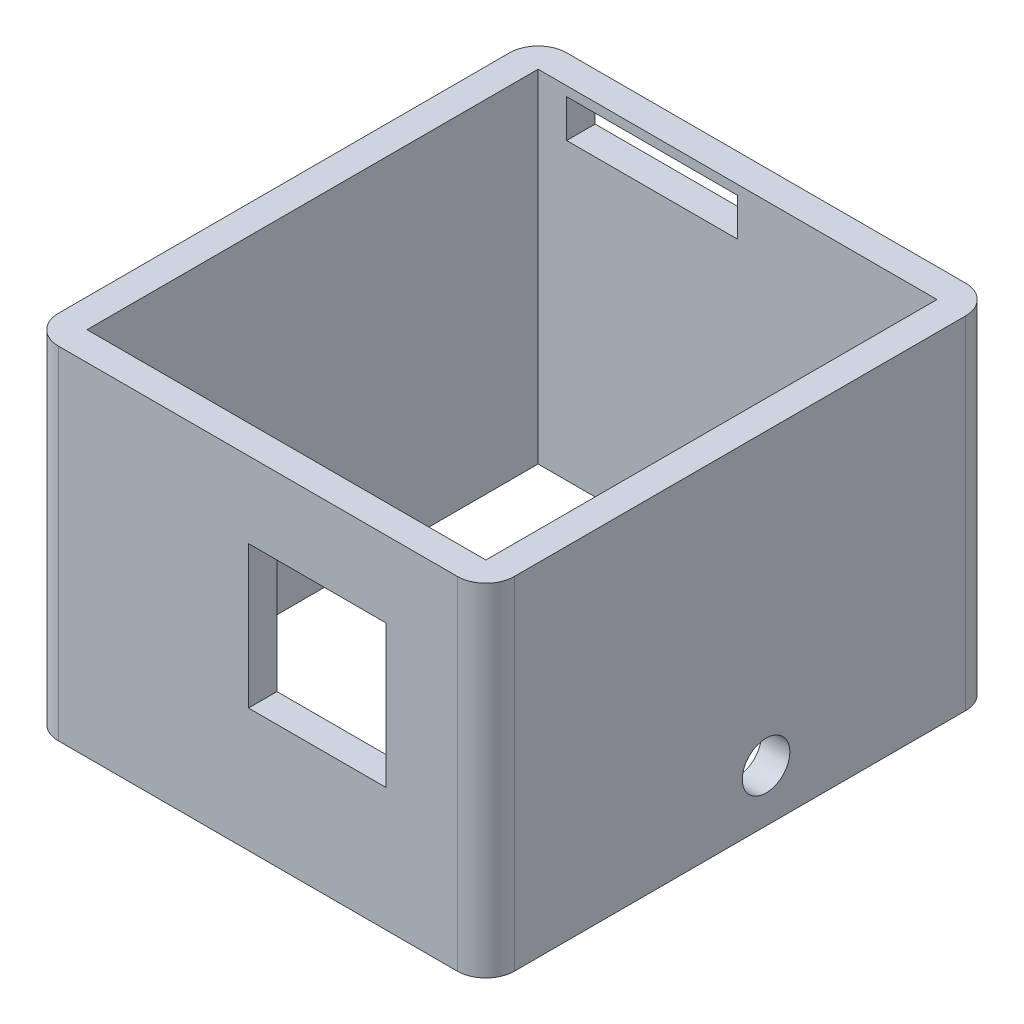
ISO-10303-21;
HEADER;
FILE_DESCRIPTION(('STEP AP214'),'2;1');
FILE_NAME('part.step','',(''),(''),'','','');
FILE_SCHEMA(('AUTOMOTIVE_DESIGN { 1 0 10303 214 1 1 1 1 }'));
ENDSEC;
DATA;
#1=APPLICATION_CONTEXT('core data for automotive mechanical design processes');
#2=APPLICATION_PROTOCOL_DEFINITION('international standard','automotive_design',2000,#1);
#3=PRODUCT_CONTEXT('',#1,'mechanical');
#4=PRODUCT('Part','Part','',(#3));
#5=PRODUCT_RELATED_PRODUCT_CATEGORY('part','',(#4));
#6=PRODUCT_DEFINITION_FORMATION('','',#4);
#7=PRODUCT_DEFINITION_CONTEXT('part definition',#1,'design');
#8=PRODUCT_DEFINITION('design','',#6,#7);
#9=PRODUCT_DEFINITION_SHAPE('','',#8);
#10=(LENGTH_UNIT() NAMED_UNIT(*) SI_UNIT(.MILLI.,.METRE.));
#11=(NAMED_UNIT(*) PLANE_ANGLE_UNIT() SI_UNIT($,.RADIAN.));
#12=(NAMED_UNIT(*) SI_UNIT($,.STERADIAN.) SOLID_ANGLE_UNIT());
#13=UNCERTAINTY_MEASURE_WITH_UNIT(LENGTH_MEASURE(1.E-05),#10,'distance_accuracy_value','');
#14=(GEOMETRIC_REPRESENTATION_CONTEXT(3) GLOBAL_UNCERTAINTY_ASSIGNED_CONTEXT((#13)) GLOBAL_UNIT_ASSIGNED_CONTEXT((#10,
#11,#12)) REPRESENTATION_CONTEXT('',''));
#15=CARTESIAN_POINT('',(0.,0.,0.));
#16=DIRECTION('',(0.,0.,1.));
#17=DIRECTION('',(1.,0.,0.));
#18=AXIS2_PLACEMENT_3D('',#15,#16,#17);
#19=CARTESIAN_POINT('',(-24.,36.,26.75));
#20=DIRECTION('',(0.,0.,-1.));
#21=DIRECTION('',(-1.,0.,0.));
#22=AXIS2_PLACEMENT_3D('',#19,#20,#21);
#23=PLANE('',#22);
#24=DIRECTION('',(1.,0.,0.));
#25=VECTOR('',#24,1.);
#26=CARTESIAN_POINT('',(-24.,0.,26.75));
#27=LINE('',#26,#25);
#28=CARTESIAN_POINT('',(-21.,0.,26.75));
#29=VERTEX_POINT('',#28);
#30=CARTESIAN_POINT('',(21.,0.,26.75));
#31=VERTEX_POINT('',#30);
#32=EDGE_CURVE('E292',#29,#31,#27,.T.);
#33=ORIENTED_EDGE('',*,*,#32,.T.);
#34=DIRECTION('',(0.,-1.,0.));
#35=VECTOR('',#34,1.);
#36=CARTESIAN_POINT('',(21.,36.,26.75));
#37=LINE('',#36,#35);
#38=CARTESIAN_POINT('',(21.,36.,26.75));
#39=VERTEX_POINT('',#38);
#40=EDGE_CURVE('E324',#31,#39,#37,.F.);
#41=ORIENTED_EDGE('',*,*,#40,.T.);
#42=DIRECTION('',(1.,0.,0.));
#43=VECTOR('',#42,1.);
#44=CARTESIAN_POINT('',(-24.,36.,26.75));
#45=LINE('',#44,#43);
#46=CARTESIAN_POINT('',(-21.,36.,26.75));
#47=VERTEX_POINT('',#46);
#48=EDGE_CURVE('E296',#47,#39,#45,.T.);
#49=ORIENTED_EDGE('',*,*,#48,.F.);
#50=DIRECTION('',(0.,-1.,0.));
#51=VECTOR('',#50,1.);
#52=CARTESIAN_POINT('',(-21.,36.,26.75));
#53=LINE('',#52,#51);
#54=EDGE_CURVE('E321',#47,#29,#53,.T.);
#55=ORIENTED_EDGE('',*,*,#54,.T.);
#56=EDGE_LOOP('',(#33,#41,#49,#55));
#57=FACE_BOUND('',#56,.T.);
#58=DIRECTION('',(0.,-1.,0.));
#59=VECTOR('',#58,1.);
#60=CARTESIAN_POINT('',(-1.00000000000239,36.,26.75));
#61=LINE('',#60,#59);
#62=CARTESIAN_POINT('',(-1.00000000000239,27.9999999999958,26.75));
#63=VERTEX_POINT('',#62);
#64=CARTESIAN_POINT('',(-1.00000000000239,13.0000000000026,26.75));
#65=VERTEX_POINT('',#64);
#66=EDGE_CURVE('E248',#63,#65,#61,.T.);
#67=ORIENTED_EDGE('',*,*,#66,.F.);
#68=DIRECTION('',(-1.,0.,0.));
#69=VECTOR('',#68,1.);
#70=CARTESIAN_POINT('',(-24.,27.9999999999958,26.75));
#71=LINE('',#70,#69);
#72=CARTESIAN_POINT('',(13.4999999999967,27.9999999999958,26.75));
#73=VERTEX_POINT('',#72);
#74=EDGE_CURVE('E241',#73,#63,#71,.T.);
#75=ORIENTED_EDGE('',*,*,#74,.F.);
#76=DIRECTION('',(0.,1.,0.));
#77=VECTOR('',#76,1.);
#78=CARTESIAN_POINT('',(13.4999999999967,36.,26.75));
#79=LINE('',#78,#77);
#80=CARTESIAN_POINT('',(13.4999999999967,13.0000000000026,26.75));
#81=VERTEX_POINT('',#80);
#82=EDGE_CURVE('E243',#81,#73,#79,.T.);
#83=ORIENTED_EDGE('',*,*,#82,.F.);
#84=DIRECTION('',(1.,0.,0.));
#85=VECTOR('',#84,1.);
#86=CARTESIAN_POINT('',(-24.,13.0000000000026,26.75));
#87=LINE('',#86,#85);
#88=EDGE_CURVE('E246',#65,#81,#87,.T.);
#89=ORIENTED_EDGE('',*,*,#88,.F.);
#90=EDGE_LOOP('',(#67,#75,#83,#89));
#91=FACE_BOUND('',#90,.T.);
#92=ADVANCED_FACE('F38',(#57,#91),#23,.F.);
#93=CARTESIAN_POINT('',(-21.,36.,23.75));
#94=DIRECTION('',(0.,0.,-1.));
#95=DIRECTION('',(-1.,0.,0.));
#96=AXIS2_PLACEMENT_3D('',#93,#94,#95);
#97=PLANE('',#96);
#98=DIRECTION('',(1.,0.,0.));
#99=VECTOR('',#98,1.);
#100=CARTESIAN_POINT('',(-21.,0.,23.75));
#101=LINE('',#100,#99);
#102=CARTESIAN_POINT('',(-21.,0.,23.75));
#103=VERTEX_POINT('',#102);
#104=CARTESIAN_POINT('',(21.,0.,23.75));
#105=VERTEX_POINT('',#104);
#106=EDGE_CURVE('E260',#103,#105,#101,.T.);
#107=ORIENTED_EDGE('',*,*,#106,.F.);
#108=DIRECTION('',(0.,-1.,0.));
#109=VECTOR('',#108,1.);
#110=CARTESIAN_POINT('',(-21.,36.,23.75));
#111=LINE('',#110,#109);
#112=CARTESIAN_POINT('',(-21.,36.,23.75));
#113=VERTEX_POINT('',#112);
#114=EDGE_CURVE('E280',#113,#103,#111,.T.);
#115=ORIENTED_EDGE('',*,*,#114,.F.);
#116=DIRECTION('',(1.,0.,0.));
#117=VECTOR('',#116,1.);
#118=CARTESIAN_POINT('',(-21.,36.,23.75));
#119=LINE('',#118,#117);
#120=CARTESIAN_POINT('',(21.,36.,23.75));
#121=VERTEX_POINT('',#120);
#122=EDGE_CURVE('E265',#113,#121,#119,.T.);
#123=ORIENTED_EDGE('',*,*,#122,.T.);
#124=DIRECTION('',(0.,-1.,0.));
#125=VECTOR('',#124,1.);
#126=CARTESIAN_POINT('',(21.,36.,23.75));
#127=LINE('',#126,#125);
#128=EDGE_CURVE('E267',#121,#105,#127,.T.);
#129=ORIENTED_EDGE('',*,*,#128,.T.);
#130=EDGE_LOOP('',(#107,#115,#123,#129));
#131=FACE_BOUND('',#130,.T.);
#132=DIRECTION('',(-1.,0.,0.));
#133=VECTOR('',#132,1.);
#134=CARTESIAN_POINT('',(-1.00000000000239,27.9999999999958,23.75));
#135=LINE('',#134,#133);
#136=CARTESIAN_POINT('',(13.4999999999967,27.9999999999958,23.75));
#137=VERTEX_POINT('',#136);
#138=CARTESIAN_POINT('',(-1.00000000000238,27.9999999999958,23.75));
#139=VERTEX_POINT('',#138);
#140=EDGE_CURVE('E229',#137,#139,#135,.T.);
#141=ORIENTED_EDGE('',*,*,#140,.T.);
#142=DIRECTION('',(0.,-1.,0.));
#143=VECTOR('',#142,1.);
#144=CARTESIAN_POINT('',(-1.00000000000239,13.0000000000026,23.75));
#145=LINE('',#144,#143);
#146=CARTESIAN_POINT('',(-1.00000000000239,13.0000000000026,23.75));
#147=VERTEX_POINT('',#146);
#148=EDGE_CURVE('E220',#139,#147,#145,.T.);
#149=ORIENTED_EDGE('',*,*,#148,.T.);
#150=DIRECTION('',(1.,0.,0.));
#151=VECTOR('',#150,1.);
#152=CARTESIAN_POINT('',(-1.00000000000239,13.0000000000026,23.75));
#153=LINE('',#152,#151);
#154=CARTESIAN_POINT('',(13.4999999999967,13.0000000000026,23.75));
#155=VERTEX_POINT('',#154);
#156=EDGE_CURVE('E223',#147,#155,#153,.T.);
#157=ORIENTED_EDGE('',*,*,#156,.T.);
#158=DIRECTION('',(0.,1.,0.));
#159=VECTOR('',#158,1.);
#160=CARTESIAN_POINT('',(13.4999999999967,13.0000000000026,23.75));
#161=LINE('',#160,#159);
#162=EDGE_CURVE('E226',#155,#137,#161,.T.);
#163=ORIENTED_EDGE('',*,*,#162,.T.);
#164=EDGE_LOOP('',(#141,#149,#157,#163));
#165=FACE_BOUND('',#164,.T.);
#166=ADVANCED_FACE('F378',(#131,#165),#97,.T.);
#167=CARTESIAN_POINT('',(0.,36.,0.));
#168=DIRECTION('',(0.,-1.,0.));
#169=DIRECTION('',(0.,0.,-1.));
#170=AXIS2_PLACEMENT_3D('',#167,#168,#169);
#171=PLANE('',#170);
#172=ORIENTED_EDGE('',*,*,#48,.T.);
#173=CARTESIAN_POINT('',(21.,36.,23.75));
#174=DIRECTION('',(0.,-1.,0.));
#175=DIRECTION('',(0.,0.,-1.));
#176=AXIS2_PLACEMENT_3D('',#173,#174,#175);
#177=CIRCLE('',#176,3.);
#178=CARTESIAN_POINT('',(24.,36.,23.75));
#179=VERTEX_POINT('',#178);
#180=EDGE_CURVE('E331',#39,#179,#177,.F.);
#181=ORIENTED_EDGE('',*,*,#180,.T.);
#182=DIRECTION('',(0.,0.,-1.));
#183=VECTOR('',#182,1.);
#184=CARTESIAN_POINT('',(24.,36.,26.75));
#185=LINE('',#184,#183);
#186=CARTESIAN_POINT('',(24.,36.,-23.75));
#187=VERTEX_POINT('',#186);
#188=EDGE_CURVE('E288',#179,#187,#185,.T.);
#189=ORIENTED_EDGE('',*,*,#188,.T.);
#190=CARTESIAN_POINT('',(21.,36.,-23.75));
#191=DIRECTION('',(0.,-1.,0.));
#192=DIRECTION('',(0.,0.,-1.));
#193=AXIS2_PLACEMENT_3D('',#190,#191,#192);
#194=CIRCLE('',#193,3.);
#195=CARTESIAN_POINT('',(21.,36.,-26.75));
#196=VERTEX_POINT('',#195);
#197=EDGE_CURVE('E326',#187,#196,#194,.F.);
#198=ORIENTED_EDGE('',*,*,#197,.T.);
#199=DIRECTION('',(-1.,0.,0.));
#200=VECTOR('',#199,1.);
#201=CARTESIAN_POINT('',(-24.,36.,-26.75));
#202=LINE('',#201,#200);
#203=CARTESIAN_POINT('',(-21.,36.,-26.75));
#204=VERTEX_POINT('',#203);
#205=EDGE_CURVE('E291',#196,#204,#202,.T.);
#206=ORIENTED_EDGE('',*,*,#205,.T.);
#207=CARTESIAN_POINT('',(-21.,36.,-23.75));
#208=DIRECTION('',(0.,-1.,0.));
#209=DIRECTION('',(0.,0.,-1.));
#210=AXIS2_PLACEMENT_3D('',#207,#208,#209);
#211=CIRCLE('',#210,3.);
#212=CARTESIAN_POINT('',(-24.,36.,-23.75));
#213=VERTEX_POINT('',#212);
#214=EDGE_CURVE('E60',#204,#213,#211,.F.);
#215=ORIENTED_EDGE('',*,*,#214,.T.);
#216=DIRECTION('',(0.,0.,1.));
#217=VECTOR('',#216,1.);
#218=CARTESIAN_POINT('',(-24.,36.,26.75));
#219=LINE('',#218,#217);
#220=CARTESIAN_POINT('',(-24.,36.,23.75));
#221=VERTEX_POINT('',#220);
#222=EDGE_CURVE('E294',#213,#221,#219,.T.);
#223=ORIENTED_EDGE('',*,*,#222,.T.);
#224=CARTESIAN_POINT('',(-21.,36.,23.75));
#225=DIRECTION('',(0.,-1.,0.));
#226=DIRECTION('',(0.,0.,-1.));
#227=AXIS2_PLACEMENT_3D('',#224,#225,#226);
#228=CIRCLE('',#227,3.);
#229=EDGE_CURVE('E329',#221,#47,#228,.F.);
#230=ORIENTED_EDGE('',*,*,#229,.T.);
#231=EDGE_LOOP('',(#172,#181,#189,#198,#206,#215,#223,#230));
#232=FACE_BOUND('',#231,.T.);
#233=DIRECTION('',(0.,0.,-1.));
#234=VECTOR('',#233,1.);
#235=CARTESIAN_POINT('',(21.,36.,23.75));
#236=LINE('',#235,#234);
#237=CARTESIAN_POINT('',(21.,36.,-23.75));
#238=VERTEX_POINT('',#237);
#239=EDGE_CURVE('E257',#121,#238,#236,.T.);
#240=ORIENTED_EDGE('',*,*,#239,.F.);
#241=ORIENTED_EDGE('',*,*,#122,.F.);
#242=DIRECTION('',(0.,0.,1.));
#243=VECTOR('',#242,1.);
#244=CARTESIAN_POINT('',(-21.,36.,23.75));
#245=LINE('',#244,#243);
#246=CARTESIAN_POINT('',(-21.,36.,-23.75));
#247=VERTEX_POINT('',#246);
#248=EDGE_CURVE('E262',#247,#113,#245,.T.);
#249=ORIENTED_EDGE('',*,*,#248,.F.);
#250=DIRECTION('',(-1.,0.,0.));
#251=VECTOR('',#250,1.);
#252=CARTESIAN_POINT('',(-21.,36.,-23.75));
#253=LINE('',#252,#251);
#254=EDGE_CURVE('E259',#238,#247,#253,.T.);
#255=ORIENTED_EDGE('',*,*,#254,.F.);
#256=EDGE_LOOP('',(#240,#241,#249,#255));
#257=FACE_BOUND('',#256,.T.);
#258=ADVANCED_FACE('F355',(#232,#257),#171,.F.);
#259=CARTESIAN_POINT('',(0.,0.,0.));
#260=DIRECTION('',(0.,-1.,0.));
#261=DIRECTION('',(0.,0.,-1.));
#262=AXIS2_PLACEMENT_3D('',#259,#260,#261);
#263=PLANE('',#262);
#264=DIRECTION('',(0.,0.,-1.));
#265=VECTOR('',#264,1.);
#266=CARTESIAN_POINT('',(24.,0.,26.75));
#267=LINE('',#266,#265);
#268=CARTESIAN_POINT('',(24.,0.,23.75));
#269=VERTEX_POINT('',#268);
#270=CARTESIAN_POINT('',(24.,0.,-23.75));
#271=VERTEX_POINT('',#270);
#272=EDGE_CURVE('E287',#269,#271,#267,.T.);
#273=ORIENTED_EDGE('',*,*,#272,.F.);
#274=CARTESIAN_POINT('',(21.,0.,23.75));
#275=DIRECTION('',(0.,-1.,0.));
#276=DIRECTION('',(0.,0.,-1.));
#277=AXIS2_PLACEMENT_3D('',#274,#275,#276);
#278=CIRCLE('',#277,3.);
#279=EDGE_CURVE('E319',#269,#31,#278,.T.);
#280=ORIENTED_EDGE('',*,*,#279,.T.);
#281=ORIENTED_EDGE('',*,*,#32,.F.);
#282=CARTESIAN_POINT('',(-21.,0.,23.75));
#283=DIRECTION('',(0.,-1.,0.));
#284=DIRECTION('',(0.,0.,-1.));
#285=AXIS2_PLACEMENT_3D('',#282,#283,#284);
#286=CIRCLE('',#285,3.);
#287=CARTESIAN_POINT('',(-24.,0.,23.75));
#288=VERTEX_POINT('',#287);
#289=EDGE_CURVE('E317',#29,#288,#286,.T.);
#290=ORIENTED_EDGE('',*,*,#289,.T.);
#291=DIRECTION('',(0.,0.,1.));
#292=VECTOR('',#291,1.);
#293=CARTESIAN_POINT('',(-24.,0.,26.75));
#294=LINE('',#293,#292);
#295=CARTESIAN_POINT('',(-24.,0.,-23.75));
#296=VERTEX_POINT('',#295);
#297=EDGE_CURVE('E305',#296,#288,#294,.T.);
#298=ORIENTED_EDGE('',*,*,#297,.F.);
#299=CARTESIAN_POINT('',(-21.,0.,-23.75));
#300=DIRECTION('',(0.,-1.,0.));
#301=DIRECTION('',(0.,0.,-1.));
#302=AXIS2_PLACEMENT_3D('',#299,#300,#301);
#303=CIRCLE('',#302,3.);
#304=CARTESIAN_POINT('',(-21.,0.,-26.75));
#305=VERTEX_POINT('',#304);
#306=EDGE_CURVE('E315',#296,#305,#303,.T.);
#307=ORIENTED_EDGE('',*,*,#306,.T.);
#308=DIRECTION('',(-1.,0.,0.));
#309=VECTOR('',#308,1.);
#310=CARTESIAN_POINT('',(-24.,0.,-26.75));
#311=LINE('',#310,#309);
#312=CARTESIAN_POINT('',(21.,0.,-26.75));
#313=VERTEX_POINT('',#312);
#314=EDGE_CURVE('E302',#313,#305,#311,.T.);
#315=ORIENTED_EDGE('',*,*,#314,.F.);
#316=CARTESIAN_POINT('',(21.,0.,-23.75));
#317=DIRECTION('',(0.,-1.,0.));
#318=DIRECTION('',(0.,0.,-1.));
#319=AXIS2_PLACEMENT_3D('',#316,#317,#318);
#320=CIRCLE('',#319,3.);
#321=EDGE_CURVE('E313',#313,#271,#320,.T.);
#322=ORIENTED_EDGE('',*,*,#321,.T.);
#323=EDGE_LOOP('',(#273,#280,#281,#290,#298,#307,#315,#322));
#324=FACE_BOUND('',#323,.T.);
#325=ORIENTED_EDGE('',*,*,#106,.T.);
#326=DIRECTION('',(0.,0.,-1.));
#327=VECTOR('',#326,1.);
#328=CARTESIAN_POINT('',(21.,0.,23.75));
#329=LINE('',#328,#327);
#330=CARTESIAN_POINT('',(21.,0.,-23.75));
#331=VERTEX_POINT('',#330);
#332=EDGE_CURVE('E256',#105,#331,#329,.T.);
#333=ORIENTED_EDGE('',*,*,#332,.T.);
#334=DIRECTION('',(-1.,0.,0.));
#335=VECTOR('',#334,1.);
#336=CARTESIAN_POINT('',(-21.,0.,-23.75));
#337=LINE('',#336,#335);
#338=CARTESIAN_POINT('',(-21.,0.,-23.75));
#339=VERTEX_POINT('',#338);
#340=EDGE_CURVE('E270',#331,#339,#337,.T.);
#341=ORIENTED_EDGE('',*,*,#340,.T.);
#342=DIRECTION('',(0.,0.,1.));
#343=VECTOR('',#342,1.);
#344=CARTESIAN_POINT('',(-21.,0.,23.75));
#345=LINE('',#344,#343);
#346=EDGE_CURVE('E273',#339,#103,#345,.T.);
#347=ORIENTED_EDGE('',*,*,#346,.T.);
#348=EDGE_LOOP('',(#325,#333,#341,#347));
#349=FACE_BOUND('',#348,.T.);
#350=ADVANCED_FACE('F347',(#324,#349),#263,.T.);
#351=CARTESIAN_POINT('',(24.,36.,26.75));
#352=DIRECTION('',(-1.,0.,0.));
#353=DIRECTION('',(0.,0.,1.));
#354=AXIS2_PLACEMENT_3D('',#351,#352,#353);
#355=PLANE('',#354);
#356=CARTESIAN_POINT('',(24.,5.5,-2.75));
#357=DIRECTION('',(-1.,0.,0.));
#358=DIRECTION('',(0.,0.,1.));
#359=AXIS2_PLACEMENT_3D('',#356,#357,#358);
#360=CIRCLE('',#359,2.5);
#361=CARTESIAN_POINT('',(24.,5.5,-0.250000000000002));
#362=VERTEX_POINT('',#361);
#363=EDGE_CURVE('E253',#362,#362,#360,.F.);
#364=ORIENTED_EDGE('',*,*,#363,.F.);
#365=EDGE_LOOP('',(#364));
#366=FACE_BOUND('',#365,.T.);
#367=ORIENTED_EDGE('',*,*,#188,.F.);
#368=DIRECTION('',(0.,-1.,0.));
#369=VECTOR('',#368,1.);
#370=CARTESIAN_POINT('',(24.,36.,23.75));
#371=LINE('',#370,#369);
#372=EDGE_CURVE('E310',#179,#269,#371,.T.);
#373=ORIENTED_EDGE('',*,*,#372,.T.);
#374=ORIENTED_EDGE('',*,*,#272,.T.);
#375=DIRECTION('',(0.,-1.,0.));
#376=VECTOR('',#375,1.);
#377=CARTESIAN_POINT('',(24.,36.,-23.75));
#378=LINE('',#377,#376);
#379=EDGE_CURVE('E299',#271,#187,#378,.F.);
#380=ORIENTED_EDGE('',*,*,#379,.T.);
#381=EDGE_LOOP('',(#367,#373,#374,#380));
#382=FACE_BOUND('',#381,.T.);
#383=ADVANCED_FACE('F371',(#366,#382),#355,.F.);
#384=CARTESIAN_POINT('',(-24.,36.,-26.75));
#385=DIRECTION('',(0.,0.,1.));
#386=DIRECTION('',(1.,0.,0.));
#387=AXIS2_PLACEMENT_3D('',#384,#385,#386);
#388=PLANE('',#387);
#389=DIRECTION('',(1.,0.,0.));
#390=VECTOR('',#389,1.);
#391=CARTESIAN_POINT('',(-24.,30.9999999999745,-26.75));
#392=LINE('',#391,#390);
#393=CARTESIAN_POINT('',(-18.0000000000005,30.9999999999745,-26.75));
#394=VERTEX_POINT('',#393);
#395=CARTESIAN_POINT('',(0.,30.9999999999745,-26.75));
#396=VERTEX_POINT('',#395);
#397=EDGE_CURVE('E214',#394,#396,#392,.T.);
#398=ORIENTED_EDGE('',*,*,#397,.T.);
#399=DIRECTION('',(0.,1.,0.));
#400=VECTOR('',#399,1.);
#401=CARTESIAN_POINT('',(0.,36.,-26.75));
#402=LINE('',#401,#400);
#403=CARTESIAN_POINT('',(0.,34.9999999999968,-26.75));
#404=VERTEX_POINT('',#403);
#405=EDGE_CURVE('E217',#396,#404,#402,.T.);
#406=ORIENTED_EDGE('',*,*,#405,.T.);
#407=DIRECTION('',(-1.,0.,0.));
#408=VECTOR('',#407,1.);
#409=CARTESIAN_POINT('',(-24.,34.9999999999968,-26.75));
#410=LINE('',#409,#408);
#411=CARTESIAN_POINT('',(-18.0000000000005,34.9999999999968,-26.75));
#412=VERTEX_POINT('',#411);
#413=EDGE_CURVE('E209',#404,#412,#410,.T.);
#414=ORIENTED_EDGE('',*,*,#413,.T.);
#415=DIRECTION('',(0.,-1.,0.));
#416=VECTOR('',#415,1.);
#417=CARTESIAN_POINT('',(-18.0000000000005,36.,-26.75));
#418=LINE('',#417,#416);
#419=EDGE_CURVE('E184',#412,#394,#418,.T.);
#420=ORIENTED_EDGE('',*,*,#419,.T.);
#421=EDGE_LOOP('',(#398,#406,#414,#420));
#422=FACE_BOUND('',#421,.T.);
#423=ORIENTED_EDGE('',*,*,#314,.T.);
#424=DIRECTION('',(0.,-1.,0.));
#425=VECTOR('',#424,1.);
#426=CARTESIAN_POINT('',(-21.,36.,-26.75));
#427=LINE('',#426,#425);
#428=EDGE_CURVE('E11',#305,#204,#427,.F.);
#429=ORIENTED_EDGE('',*,*,#428,.T.);
#430=ORIENTED_EDGE('',*,*,#205,.F.);
#431=DIRECTION('',(0.,-1.,0.));
#432=VECTOR('',#431,1.);
#433=CARTESIAN_POINT('',(21.,36.,-26.75));
#434=LINE('',#433,#432);
#435=EDGE_CURVE('E46',#196,#313,#434,.T.);
#436=ORIENTED_EDGE('',*,*,#435,.T.);
#437=EDGE_LOOP('',(#423,#429,#430,#436));
#438=FACE_BOUND('',#437,.T.);
#439=ADVANCED_FACE('F341',(#422,#438),#388,.F.);
#440=CARTESIAN_POINT('',(-24.,36.,26.75));
#441=DIRECTION('',(1.,0.,0.));
#442=DIRECTION('',(0.,0.,-1.));
#443=AXIS2_PLACEMENT_3D('',#440,#441,#442);
#444=PLANE('',#443);
#445=ORIENTED_EDGE('',*,*,#297,.T.);
#446=DIRECTION('',(0.,-1.,0.));
#447=VECTOR('',#446,1.);
#448=CARTESIAN_POINT('',(-24.,36.,23.75));
#449=LINE('',#448,#447);
#450=EDGE_CURVE('E53',#288,#221,#449,.F.);
#451=ORIENTED_EDGE('',*,*,#450,.T.);
#452=ORIENTED_EDGE('',*,*,#222,.F.);
#453=DIRECTION('',(0.,-1.,0.));
#454=VECTOR('',#453,1.);
#455=CARTESIAN_POINT('',(-24.,36.,-23.75));
#456=LINE('',#455,#454);
#457=EDGE_CURVE('E333',#213,#296,#456,.T.);
#458=ORIENTED_EDGE('',*,*,#457,.T.);
#459=EDGE_LOOP('',(#445,#451,#452,#458));
#460=FACE_BOUND('',#459,.T.);
#461=ADVANCED_FACE('F353',(#460),#444,.F.);
#462=CARTESIAN_POINT('',(21.,36.,23.75));
#463=DIRECTION('',(-1.,0.,0.));
#464=DIRECTION('',(0.,0.,1.));
#465=AXIS2_PLACEMENT_3D('',#462,#463,#464);
#466=PLANE('',#465);
#467=CARTESIAN_POINT('',(21.,5.5,-2.75));
#468=DIRECTION('',(1.,0.,0.));
#469=DIRECTION('',(0.,0.,-1.));
#470=AXIS2_PLACEMENT_3D('',#467,#468,#469);
#471=CIRCLE('',#470,2.5);
#472=CARTESIAN_POINT('',(21.,5.5,-5.25));
#473=VERTEX_POINT('',#472);
#474=EDGE_CURVE('E250',#473,#473,#471,.T.);
#475=ORIENTED_EDGE('',*,*,#474,.T.);
#476=EDGE_LOOP('',(#475));
#477=FACE_BOUND('',#476,.T.);
#478=ORIENTED_EDGE('',*,*,#332,.F.);
#479=ORIENTED_EDGE('',*,*,#128,.F.);
#480=ORIENTED_EDGE('',*,*,#239,.T.);
#481=DIRECTION('',(0.,-1.,0.));
#482=VECTOR('',#481,1.);
#483=CARTESIAN_POINT('',(21.,36.,-23.75));
#484=LINE('',#483,#482);
#485=EDGE_CURVE('E284',#238,#331,#484,.T.);
#486=ORIENTED_EDGE('',*,*,#485,.T.);
#487=EDGE_LOOP('',(#478,#479,#480,#486));
#488=FACE_BOUND('',#487,.T.);
#489=ADVANCED_FACE('F390',(#477,#488),#466,.T.);
#490=CARTESIAN_POINT('',(-21.,36.,-23.75));
#491=DIRECTION('',(0.,0.,1.));
#492=DIRECTION('',(1.,0.,0.));
#493=AXIS2_PLACEMENT_3D('',#490,#491,#492);
#494=PLANE('',#493);
#495=DIRECTION('',(0.,1.,0.));
#496=VECTOR('',#495,1.);
#497=CARTESIAN_POINT('',(0.,30.9999999999745,-23.75));
#498=LINE('',#497,#496);
#499=CARTESIAN_POINT('',(0.,30.9999999999745,-23.75));
#500=VERTEX_POINT('',#499);
#501=CARTESIAN_POINT('',(0.,34.9999999999968,-23.75));
#502=VERTEX_POINT('',#501);
#503=EDGE_CURVE('E197',#500,#502,#498,.T.);
#504=ORIENTED_EDGE('',*,*,#503,.F.);
#505=DIRECTION('',(1.,0.,0.));
#506=VECTOR('',#505,1.);
#507=CARTESIAN_POINT('',(0.,30.9999999999745,-23.75));
#508=LINE('',#507,#506);
#509=CARTESIAN_POINT('',(-18.0000000000005,30.9999999999745,-23.75));
#510=VERTEX_POINT('',#509);
#511=EDGE_CURVE('E202',#510,#500,#508,.T.);
#512=ORIENTED_EDGE('',*,*,#511,.F.);
#513=DIRECTION('',(0.,-1.,0.));
#514=VECTOR('',#513,1.);
#515=CARTESIAN_POINT('',(-18.0000000000005,30.9999999999745,-23.75));
#516=LINE('',#515,#514);
#517=CARTESIAN_POINT('',(-18.0000000000005,34.9999999999968,-23.75));
#518=VERTEX_POINT('',#517);
#519=EDGE_CURVE('E181',#518,#510,#516,.T.);
#520=ORIENTED_EDGE('',*,*,#519,.F.);
#521=DIRECTION('',(-1.,0.,0.));
#522=VECTOR('',#521,1.);
#523=CARTESIAN_POINT('',(0.,34.9999999999968,-23.75));
#524=LINE('',#523,#522);
#525=EDGE_CURVE('E192',#502,#518,#524,.T.);
#526=ORIENTED_EDGE('',*,*,#525,.F.);
#527=EDGE_LOOP('',(#504,#512,#520,#526));
#528=FACE_BOUND('',#527,.T.);
#529=ORIENTED_EDGE('',*,*,#340,.F.);
#530=ORIENTED_EDGE('',*,*,#485,.F.);
#531=ORIENTED_EDGE('',*,*,#254,.T.);
#532=DIRECTION('',(0.,-1.,0.));
#533=VECTOR('',#532,1.);
#534=CARTESIAN_POINT('',(-21.,36.,-23.75));
#535=LINE('',#534,#533);
#536=EDGE_CURVE('E282',#247,#339,#535,.T.);
#537=ORIENTED_EDGE('',*,*,#536,.T.);
#538=EDGE_LOOP('',(#529,#530,#531,#537));
#539=FACE_BOUND('',#538,.T.);
#540=ADVANCED_FACE('F199',(#528,#539),#494,.T.);
#541=CARTESIAN_POINT('',(-21.,36.,23.75));
#542=DIRECTION('',(1.,0.,0.));
#543=DIRECTION('',(0.,0.,-1.));
#544=AXIS2_PLACEMENT_3D('',#541,#542,#543);
#545=PLANE('',#544);
#546=ORIENTED_EDGE('',*,*,#346,.F.);
#547=ORIENTED_EDGE('',*,*,#536,.F.);
#548=ORIENTED_EDGE('',*,*,#248,.T.);
#549=ORIENTED_EDGE('',*,*,#114,.T.);
#550=EDGE_LOOP('',(#546,#547,#548,#549));
#551=FACE_BOUND('',#550,.T.);
#552=ADVANCED_FACE('F509',(#551),#545,.T.);
#553=CARTESIAN_POINT('',(30.,5.5,-2.75));
#554=DIRECTION('',(-1.,0.,0.));
#555=DIRECTION('',(0.,0.,1.));
#556=AXIS2_PLACEMENT_3D('',#553,#554,#555);
#557=CYLINDRICAL_SURFACE('',#556,2.5);
#558=ORIENTED_EDGE('',*,*,#474,.F.);
#559=EDGE_LOOP('',(#558));
#560=FACE_BOUND('',#559,.T.);
#561=ORIENTED_EDGE('',*,*,#363,.T.);
#562=EDGE_LOOP('',(#561));
#563=FACE_BOUND('',#562,.T.);
#564=ADVANCED_FACE('F490',(#560,#563),#557,.F.);
#565=CARTESIAN_POINT('',(-1.00000000000239,13.0000000000026,38.75));
#566=DIRECTION('',(1.,0.,0.));
#567=DIRECTION('',(0.,0.,-1.));
#568=AXIS2_PLACEMENT_3D('',#565,#566,#567);
#569=PLANE('',#568);
#570=ORIENTED_EDGE('',*,*,#66,.T.);
#571=DIRECTION('',(0.,0.,-1.));
#572=VECTOR('',#571,1.);
#573=CARTESIAN_POINT('',(-1.00000000000239,13.0000000000026,38.75));
#574=LINE('',#573,#572);
#575=EDGE_CURVE('E239',#65,#147,#574,.T.);
#576=ORIENTED_EDGE('',*,*,#575,.T.);
#577=ORIENTED_EDGE('',*,*,#148,.F.);
#578=DIRECTION('',(0.,0.,-1.));
#579=VECTOR('',#578,1.);
#580=CARTESIAN_POINT('',(-1.00000000000239,27.9999999999958,38.75));
#581=LINE('',#580,#579);
#582=EDGE_CURVE('E232',#63,#139,#581,.T.);
#583=ORIENTED_EDGE('',*,*,#582,.F.);
#584=EDGE_LOOP('',(#570,#576,#577,#583));
#585=FACE_BOUND('',#584,.T.);
#586=ADVANCED_FACE('F481',(#585),#569,.T.);
#587=CARTESIAN_POINT('',(-1.00000000000239,13.0000000000026,38.75));
#588=DIRECTION('',(0.,1.,0.));
#589=DIRECTION('',(0.,0.,1.));
#590=AXIS2_PLACEMENT_3D('',#587,#588,#589);
#591=PLANE('',#590);
#592=ORIENTED_EDGE('',*,*,#88,.T.);
#593=DIRECTION('',(0.,0.,-1.));
#594=VECTOR('',#593,1.);
#595=CARTESIAN_POINT('',(13.4999999999967,13.0000000000026,38.75));
#596=LINE('',#595,#594);
#597=EDGE_CURVE('E237',#81,#155,#596,.T.);
#598=ORIENTED_EDGE('',*,*,#597,.T.);
#599=ORIENTED_EDGE('',*,*,#156,.F.);
#600=ORIENTED_EDGE('',*,*,#575,.F.);
#601=EDGE_LOOP('',(#592,#598,#599,#600));
#602=FACE_BOUND('',#601,.T.);
#603=ADVANCED_FACE('F472',(#602),#591,.T.);
#604=CARTESIAN_POINT('',(13.4999999999967,13.0000000000026,38.75));
#605=DIRECTION('',(-1.,0.,0.));
#606=DIRECTION('',(0.,0.,1.));
#607=AXIS2_PLACEMENT_3D('',#604,#605,#606);
#608=PLANE('',#607);
#609=ORIENTED_EDGE('',*,*,#82,.T.);
#610=DIRECTION('',(0.,0.,-1.));
#611=VECTOR('',#610,1.);
#612=CARTESIAN_POINT('',(13.4999999999967,27.9999999999958,38.75));
#613=LINE('',#612,#611);
#614=EDGE_CURVE('E235',#73,#137,#613,.T.);
#615=ORIENTED_EDGE('',*,*,#614,.T.);
#616=ORIENTED_EDGE('',*,*,#162,.F.);
#617=ORIENTED_EDGE('',*,*,#597,.F.);
#618=EDGE_LOOP('',(#609,#615,#616,#617));
#619=FACE_BOUND('',#618,.T.);
#620=ADVANCED_FACE('F463',(#619),#608,.T.);
#621=CARTESIAN_POINT('',(-1.00000000000239,27.9999999999958,38.75));
#622=DIRECTION('',(0.,-1.,0.));
#623=DIRECTION('',(0.,0.,-1.));
#624=AXIS2_PLACEMENT_3D('',#621,#622,#623);
#625=PLANE('',#624);
#626=ORIENTED_EDGE('',*,*,#74,.T.);
#627=ORIENTED_EDGE('',*,*,#582,.T.);
#628=ORIENTED_EDGE('',*,*,#140,.F.);
#629=ORIENTED_EDGE('',*,*,#614,.F.);
#630=EDGE_LOOP('',(#626,#627,#628,#629));
#631=FACE_BOUND('',#630,.T.);
#632=ADVANCED_FACE('F453',(#631),#625,.T.);
#633=CARTESIAN_POINT('',(0.,30.9999999999745,-38.75));
#634=DIRECTION('',(1.,0.,0.));
#635=DIRECTION('',(0.,0.,-1.));
#636=AXIS2_PLACEMENT_3D('',#633,#634,#635);
#637=PLANE('',#636);
#638=DIRECTION('',(0.,0.,1.));
#639=VECTOR('',#638,1.);
#640=CARTESIAN_POINT('',(0.,30.9999999999745,-38.75));
#641=LINE('',#640,#639);
#642=EDGE_CURVE('E207',#396,#500,#641,.T.);
#643=ORIENTED_EDGE('',*,*,#642,.T.);
#644=ORIENTED_EDGE('',*,*,#503,.T.);
#645=DIRECTION('',(0.,0.,1.));
#646=VECTOR('',#645,1.);
#647=CARTESIAN_POINT('',(0.,34.9999999999968,-38.75));
#648=LINE('',#647,#646);
#649=EDGE_CURVE('E188',#404,#502,#648,.T.);
#650=ORIENTED_EDGE('',*,*,#649,.F.);
#651=ORIENTED_EDGE('',*,*,#405,.F.);
#652=EDGE_LOOP('',(#643,#644,#650,#651));
#653=FACE_BOUND('',#652,.T.);
#654=ADVANCED_FACE('F444',(#653),#637,.F.);
#655=CARTESIAN_POINT('',(0.,30.9999999999745,-38.75));
#656=DIRECTION('',(0.,-1.,0.));
#657=DIRECTION('',(0.,0.,-1.));
#658=AXIS2_PLACEMENT_3D('',#655,#656,#657);
#659=PLANE('',#658);
#660=DIRECTION('',(0.,0.,1.));
#661=VECTOR('',#660,1.);
#662=CARTESIAN_POINT('',(-18.0000000000005,30.9999999999745,-38.75));
#663=LINE('',#662,#661);
#664=EDGE_CURVE('E187',#394,#510,#663,.T.);
#665=ORIENTED_EDGE('',*,*,#664,.T.);
#666=ORIENTED_EDGE('',*,*,#511,.T.);
#667=ORIENTED_EDGE('',*,*,#642,.F.);
#668=ORIENTED_EDGE('',*,*,#397,.F.);
#669=EDGE_LOOP('',(#665,#666,#667,#668));
#670=FACE_BOUND('',#669,.T.);
#671=ADVANCED_FACE('F436',(#670),#659,.F.);
#672=CARTESIAN_POINT('',(-18.0000000000005,30.9999999999745,-38.75));
#673=DIRECTION('',(-1.,0.,0.));
#674=DIRECTION('',(0.,0.,1.));
#675=AXIS2_PLACEMENT_3D('',#672,#673,#674);
#676=PLANE('',#675);
#677=DIRECTION('',(0.,0.,1.));
#678=VECTOR('',#677,1.);
#679=CARTESIAN_POINT('',(-18.0000000000005,34.9999999999968,-38.75));
#680=LINE('',#679,#678);
#681=EDGE_CURVE('E176',#412,#518,#680,.T.);
#682=ORIENTED_EDGE('',*,*,#681,.T.);
#683=ORIENTED_EDGE('',*,*,#519,.T.);
#684=ORIENTED_EDGE('',*,*,#664,.F.);
#685=ORIENTED_EDGE('',*,*,#419,.F.);
#686=EDGE_LOOP('',(#682,#683,#684,#685));
#687=FACE_BOUND('',#686,.T.);
#688=ADVANCED_FACE('F178',(#687),#676,.F.);
#689=CARTESIAN_POINT('',(0.,34.9999999999968,-38.75));
#690=DIRECTION('',(0.,1.,0.));
#691=DIRECTION('',(0.,0.,1.));
#692=AXIS2_PLACEMENT_3D('',#689,#690,#691);
#693=PLANE('',#692);
#694=ORIENTED_EDGE('',*,*,#649,.T.);
#695=ORIENTED_EDGE('',*,*,#525,.T.);
#696=ORIENTED_EDGE('',*,*,#681,.F.);
#697=ORIENTED_EDGE('',*,*,#413,.F.);
#698=EDGE_LOOP('',(#694,#695,#696,#697));
#699=FACE_BOUND('',#698,.T.);
#700=ADVANCED_FACE('F193',(#699),#693,.F.);
#701=CARTESIAN_POINT('',(21.,36.,23.75));
#702=DIRECTION('',(0.,-1.,0.));
#703=DIRECTION('',(0.,0.,-1.));
#704=AXIS2_PLACEMENT_3D('',#701,#702,#703);
#705=CYLINDRICAL_SURFACE('',#704,3.);
#706=ORIENTED_EDGE('',*,*,#180,.F.);
#707=ORIENTED_EDGE('',*,*,#40,.F.);
#708=ORIENTED_EDGE('',*,*,#279,.F.);
#709=ORIENTED_EDGE('',*,*,#372,.F.);
#710=EDGE_LOOP('',(#706,#707,#708,#709));
#711=FACE_BOUND('',#710,.T.);
#712=ADVANCED_FACE('F368',(#711),#705,.T.);
#713=CARTESIAN_POINT('',(-21.,36.,23.75));
#714=DIRECTION('',(0.,-1.,0.));
#715=DIRECTION('',(0.,0.,-1.));
#716=AXIS2_PLACEMENT_3D('',#713,#714,#715);
#717=CYLINDRICAL_SURFACE('',#716,3.);
#718=ORIENTED_EDGE('',*,*,#229,.F.);
#719=ORIENTED_EDGE('',*,*,#450,.F.);
#720=ORIENTED_EDGE('',*,*,#289,.F.);
#721=ORIENTED_EDGE('',*,*,#54,.F.);
#722=EDGE_LOOP('',(#718,#719,#720,#721));
#723=FACE_BOUND('',#722,.T.);
#724=ADVANCED_FACE('F360',(#723),#717,.T.);
#725=CARTESIAN_POINT('',(-21.,36.,-23.75));
#726=DIRECTION('',(0.,-1.,0.));
#727=DIRECTION('',(0.,0.,-1.));
#728=AXIS2_PLACEMENT_3D('',#725,#726,#727);
#729=CYLINDRICAL_SURFACE('',#728,3.);
#730=ORIENTED_EDGE('',*,*,#214,.F.);
#731=ORIENTED_EDGE('',*,*,#428,.F.);
#732=ORIENTED_EDGE('',*,*,#306,.F.);
#733=ORIENTED_EDGE('',*,*,#457,.F.);
#734=EDGE_LOOP('',(#730,#731,#732,#733));
#735=FACE_BOUND('',#734,.T.);
#736=ADVANCED_FACE('F352',(#735),#729,.T.);
#737=CARTESIAN_POINT('',(21.,36.,-23.75));
#738=DIRECTION('',(0.,-1.,0.));
#739=DIRECTION('',(0.,0.,-1.));
#740=AXIS2_PLACEMENT_3D('',#737,#738,#739);
#741=CYLINDRICAL_SURFACE('',#740,3.);
#742=ORIENTED_EDGE('',*,*,#197,.F.);
#743=ORIENTED_EDGE('',*,*,#379,.F.);
#744=ORIENTED_EDGE('',*,*,#321,.F.);
#745=ORIENTED_EDGE('',*,*,#435,.F.);
#746=EDGE_LOOP('',(#742,#743,#744,#745));
#747=FACE_BOUND('',#746,.T.);
#748=ADVANCED_FACE('F40',(#747),#741,.T.);
#749=CLOSED_SHELL('',(#92,#166,#258,#350,#383,#439,#461,#489,#540,#552,#564,#586,#603,#620,#632,
#654,#671,#688,#700,#712,#724,#736,#748));
#750=MANIFOLD_SOLID_BREP('B2',#749);
#751=ADVANCED_BREP_SHAPE_REPRESENTATION('',(#18,#750),#14);
#752=SHAPE_DEFINITION_REPRESENTATION(#9,#751);
ENDSEC;
END-ISO-10303-21;
